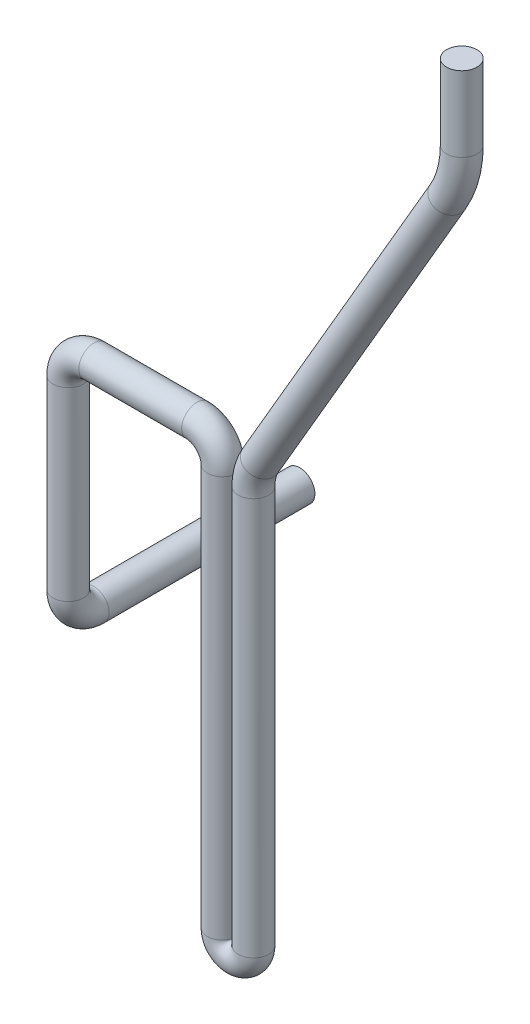
ISO-10303-21;
HEADER;
FILE_DESCRIPTION(('STEP AP214'),'2;1');
FILE_NAME('part.step','',(''),(''),'','','');
FILE_SCHEMA(('AUTOMOTIVE_DESIGN { 1 0 10303 214 1 1 1 1 }'));
ENDSEC;
DATA;
#1=APPLICATION_CONTEXT('core data for automotive mechanical design processes');
#2=APPLICATION_PROTOCOL_DEFINITION('international standard','automotive_design',2000,#1);
#3=PRODUCT_CONTEXT('',#1,'mechanical');
#4=PRODUCT('Part','Part','',(#3));
#5=PRODUCT_RELATED_PRODUCT_CATEGORY('part','',(#4));
#6=PRODUCT_DEFINITION_FORMATION('','',#4);
#7=PRODUCT_DEFINITION_CONTEXT('part definition',#1,'design');
#8=PRODUCT_DEFINITION('design','',#6,#7);
#9=PRODUCT_DEFINITION_SHAPE('','',#8);
#10=(LENGTH_UNIT() NAMED_UNIT(*) SI_UNIT(.MILLI.,.METRE.));
#11=(NAMED_UNIT(*) PLANE_ANGLE_UNIT() SI_UNIT($,.RADIAN.));
#12=(NAMED_UNIT(*) SI_UNIT($,.STERADIAN.) SOLID_ANGLE_UNIT());
#13=UNCERTAINTY_MEASURE_WITH_UNIT(LENGTH_MEASURE(1.E-05),#10,'distance_accuracy_value','');
#14=(GEOMETRIC_REPRESENTATION_CONTEXT(3) GLOBAL_UNCERTAINTY_ASSIGNED_CONTEXT((#13)) GLOBAL_UNIT_ASSIGNED_CONTEXT((#10,
#11,#12)) REPRESENTATION_CONTEXT('',''));
#15=CARTESIAN_POINT('',(0.,0.,0.));
#16=DIRECTION('',(0.,0.,1.));
#17=DIRECTION('',(1.,0.,0.));
#18=AXIS2_PLACEMENT_3D('',#15,#16,#17);
#19=CARTESIAN_POINT('',(11.25,7.5,0.));
#20=DIRECTION('',(0.,1.,0.));
#21=DIRECTION('',(0.,0.,1.));
#22=AXIS2_PLACEMENT_3D('',#19,#20,#21);
#23=CYLINDRICAL_SURFACE('',#22,0.295);
#24=CARTESIAN_POINT('',(11.25,7.5,0.));
#25=DIRECTION('',(0.,1.,0.));
#26=DIRECTION('',(1.,0.,0.));
#27=AXIS2_PLACEMENT_3D('',#24,#25,#26);
#28=CIRCLE('',#27,0.295);
#29=CARTESIAN_POINT('',(11.545,7.5,0.));
#30=VERTEX_POINT('',#29);
#31=EDGE_CURVE('E36',#30,#30,#28,.T.);
#32=ORIENTED_EDGE('',*,*,#31,.T.);
#33=EDGE_LOOP('',(#32));
#34=FACE_BOUND('',#33,.T.);
#35=CARTESIAN_POINT('',(11.25,8.96048512716335,0.));
#36=DIRECTION('',(0.,1.,0.));
#37=DIRECTION('',(1.,0.,0.));
#38=AXIS2_PLACEMENT_3D('',#35,#36,#37);
#39=CIRCLE('',#38,0.295);
#40=CARTESIAN_POINT('',(11.545,8.96048512716335,0.));
#41=VERTEX_POINT('',#40);
#42=EDGE_CURVE('E10',#41,#41,#39,.T.);
#43=ORIENTED_EDGE('',*,*,#42,.F.);
#44=EDGE_LOOP('',(#43));
#45=FACE_BOUND('',#44,.T.);
#46=ADVANCED_FACE('F30',(#34,#45),#23,.T.);
#47=CARTESIAN_POINT('',(9.25,7.5,0.));
#48=DIRECTION('',(0.,0.,1.));
#49=DIRECTION('',(1.,0.,0.));
#50=AXIS2_PLACEMENT_3D('',#47,#48,#49);
#51=TOROIDAL_SURFACE('',#50,2.,0.295);
#52=CARTESIAN_POINT('',(10.9786682614832,6.49416400852792,0.));
#53=DIRECTION('',(0.502917995736042,0.864334130741603,0.));
#54=DIRECTION('',(0.864334130741603,-0.502917995736042,0.));
#55=AXIS2_PLACEMENT_3D('',#52,#53,#54);
#56=CIRCLE('',#55,0.295);
#57=CARTESIAN_POINT('',(11.233646830052,6.34580319978579,0.));
#58=VERTEX_POINT('',#57);
#59=EDGE_CURVE('E40',#58,#58,#56,.T.);
#60=CARTESIAN_POINT('',(9.25,7.5,0.));
#61=DIRECTION('',(0.,0.,1.));
#62=DIRECTION('',(1.,0.,0.));
#63=AXIS2_PLACEMENT_3D('',#60,#61,#62);
#64=CIRCLE('',#63,2.295);
#65=EDGE_CURVE('',#58,#30,#64,.T.);
#66=ORIENTED_EDGE('',*,*,#59,.T.);
#67=ORIENTED_EDGE('',*,*,#31,.F.);
#68=ORIENTED_EDGE('',*,*,#65,.T.);
#69=ORIENTED_EDGE('',*,*,#65,.F.);
#70=EDGE_LOOP('',(#66,#68,#67,#69));
#71=FACE_BOUND('',#70,.T.);
#72=ADVANCED_FACE('F98',(#71),#51,.T.);
#73=CARTESIAN_POINT('',(7.3356658692584,0.233160559317716,0.));
#74=DIRECTION('',(0.502917995736039,0.864334130741605,0.));
#75=DIRECTION('',(-0.864334130741605,0.502917995736039,0.));
#76=AXIS2_PLACEMENT_3D('',#73,#74,#75);
#77=CYLINDRICAL_SURFACE('',#76,0.295);
#78=CARTESIAN_POINT('',(7.3356658692584,0.233160559317716,0.));
#79=DIRECTION('',(0.502917995736042,0.864334130741603,0.));
#80=DIRECTION('',(0.864334130741603,-0.502917995736042,0.));
#81=AXIS2_PLACEMENT_3D('',#78,#79,#80);
#82=CIRCLE('',#81,0.295);
#83=CARTESIAN_POINT('',(7.08068730068962,0.381521368059849,0.));
#84=VERTEX_POINT('',#83);
#85=EDGE_CURVE('E44',#84,#84,#82,.T.);
#86=ORIENTED_EDGE('',*,*,#85,.T.);
#87=EDGE_LOOP('',(#86));
#88=FACE_BOUND('',#87,.T.);
#89=ORIENTED_EDGE('',*,*,#59,.F.);
#90=EDGE_LOOP('',(#89));
#91=FACE_BOUND('',#90,.T.);
#92=ADVANCED_FACE('F102',(#88,#91),#77,.T.);
#93=CARTESIAN_POINT('',(8.2,-0.269757436418325,0.));
#94=DIRECTION('',(0.,0.,-1.));
#95=DIRECTION('',(-1.,0.,0.));
#96=AXIS2_PLACEMENT_3D('',#93,#94,#95);
#97=TOROIDAL_SURFACE('',#96,1.,0.295);
#98=CARTESIAN_POINT('',(7.2,-0.269757436418325,0.));
#99=DIRECTION('',(0.,1.,0.));
#100=DIRECTION('',(1.,0.,0.));
#101=AXIS2_PLACEMENT_3D('',#98,#99,#100);
#102=CIRCLE('',#101,0.295);
#103=CARTESIAN_POINT('',(6.905,-0.269757436418325,0.));
#104=VERTEX_POINT('',#103);
#105=EDGE_CURVE('E49',#104,#104,#102,.T.);
#106=CARTESIAN_POINT('',(8.2,-0.269757436418325,0.));
#107=DIRECTION('',(0.,0.,-1.));
#108=DIRECTION('',(-1.,0.,0.));
#109=AXIS2_PLACEMENT_3D('',#106,#107,#108);
#110=CIRCLE('',#109,1.295);
#111=EDGE_CURVE('',#104,#84,#110,.T.);
#112=ORIENTED_EDGE('',*,*,#105,.T.);
#113=ORIENTED_EDGE('',*,*,#85,.F.);
#114=ORIENTED_EDGE('',*,*,#111,.T.);
#115=ORIENTED_EDGE('',*,*,#111,.F.);
#116=EDGE_LOOP('',(#112,#114,#113,#115));
#117=FACE_BOUND('',#116,.T.);
#118=ADVANCED_FACE('F108',(#117),#97,.T.);
#119=CARTESIAN_POINT('',(7.2,-8.,0.));
#120=DIRECTION('',(0.,1.,0.));
#121=DIRECTION('',(0.,0.,1.));
#122=AXIS2_PLACEMENT_3D('',#119,#120,#121);
#123=CYLINDRICAL_SURFACE('',#122,0.295);
#124=CARTESIAN_POINT('',(7.2,-8.,0.));
#125=DIRECTION('',(0.,1.,0.));
#126=DIRECTION('',(1.,0.,0.));
#127=AXIS2_PLACEMENT_3D('',#124,#125,#126);
#128=CIRCLE('',#127,0.295);
#129=CARTESIAN_POINT('',(7.495,-8.,0.));
#130=VERTEX_POINT('',#129);
#131=EDGE_CURVE('E52',#130,#130,#128,.T.);
#132=ORIENTED_EDGE('',*,*,#131,.T.);
#133=EDGE_LOOP('',(#132));
#134=FACE_BOUND('',#133,.T.);
#135=ORIENTED_EDGE('',*,*,#105,.F.);
#136=EDGE_LOOP('',(#135));
#137=FACE_BOUND('',#136,.T.);
#138=ADVANCED_FACE('F115',(#134,#137),#123,.T.);
#139=CARTESIAN_POINT('',(6.9,-8.,0.));
#140=DIRECTION('',(0.,0.,1.));
#141=DIRECTION('',(1.,0.,0.));
#142=AXIS2_PLACEMENT_3D('',#139,#140,#141);
#143=TOROIDAL_SURFACE('',#142,0.3,0.295);
#144=CARTESIAN_POINT('',(6.6,-8.,0.));
#145=DIRECTION('',(0.,-1.,0.));
#146=DIRECTION('',(-1.,0.,0.));
#147=AXIS2_PLACEMENT_3D('',#144,#145,#146);
#148=CIRCLE('',#147,0.295);
#149=CARTESIAN_POINT('',(6.305,-8.,0.));
#150=VERTEX_POINT('',#149);
#151=EDGE_CURVE('E55',#150,#150,#148,.T.);
#152=CARTESIAN_POINT('',(6.9,-8.,0.));
#153=DIRECTION('',(0.,0.,1.));
#154=DIRECTION('',(1.,0.,0.));
#155=AXIS2_PLACEMENT_3D('',#152,#153,#154);
#156=CIRCLE('',#155,0.595);
#157=EDGE_CURVE('',#150,#130,#156,.T.);
#158=ORIENTED_EDGE('',*,*,#151,.T.);
#159=ORIENTED_EDGE('',*,*,#131,.F.);
#160=ORIENTED_EDGE('',*,*,#157,.T.);
#161=ORIENTED_EDGE('',*,*,#157,.F.);
#162=EDGE_LOOP('',(#158,#160,#159,#161));
#163=FACE_BOUND('',#162,.T.);
#164=ADVANCED_FACE('F119',(#163),#143,.T.);
#165=CARTESIAN_POINT('',(6.6,-0.200000000000001,0.));
#166=DIRECTION('',(0.,-1.,0.));
#167=DIRECTION('',(0.,0.,-1.));
#168=AXIS2_PLACEMENT_3D('',#165,#166,#167);
#169=CYLINDRICAL_SURFACE('',#168,0.295);
#170=CARTESIAN_POINT('',(6.6,-0.200000000000001,0.));
#171=DIRECTION('',(0.,-1.,0.));
#172=DIRECTION('',(-1.,0.,0.));
#173=AXIS2_PLACEMENT_3D('',#170,#171,#172);
#174=CIRCLE('',#173,0.295);
#175=CARTESIAN_POINT('',(6.895,-0.200000000000001,0.));
#176=VERTEX_POINT('',#175);
#177=EDGE_CURVE('E58',#176,#176,#174,.T.);
#178=ORIENTED_EDGE('',*,*,#177,.T.);
#179=EDGE_LOOP('',(#178));
#180=FACE_BOUND('',#179,.T.);
#181=ORIENTED_EDGE('',*,*,#151,.F.);
#182=EDGE_LOOP('',(#181));
#183=FACE_BOUND('',#182,.T.);
#184=ADVANCED_FACE('F123',(#180,#183),#169,.T.);
#185=CARTESIAN_POINT('',(6.1,-0.2,0.));
#186=DIRECTION('',(0.,0.,-1.));
#187=DIRECTION('',(-1.,0.,0.));
#188=AXIS2_PLACEMENT_3D('',#185,#186,#187);
#189=TOROIDAL_SURFACE('',#188,0.5,0.295);
#190=CARTESIAN_POINT('',(6.1,0.3,0.));
#191=DIRECTION('',(1.,0.,0.));
#192=DIRECTION('',(0.,-1.,0.));
#193=AXIS2_PLACEMENT_3D('',#190,#191,#192);
#194=CIRCLE('',#193,0.295);
#195=CARTESIAN_POINT('',(6.1,0.595,0.));
#196=VERTEX_POINT('',#195);
#197=EDGE_CURVE('E61',#196,#196,#194,.T.);
#198=CARTESIAN_POINT('',(6.1,-0.2,0.));
#199=DIRECTION('',(0.,0.,-1.));
#200=DIRECTION('',(-1.,0.,0.));
#201=AXIS2_PLACEMENT_3D('',#198,#199,#200);
#202=CIRCLE('',#201,0.795);
#203=EDGE_CURVE('',#196,#176,#202,.T.);
#204=ORIENTED_EDGE('',*,*,#197,.T.);
#205=ORIENTED_EDGE('',*,*,#177,.F.);
#206=ORIENTED_EDGE('',*,*,#203,.T.);
#207=ORIENTED_EDGE('',*,*,#203,.F.);
#208=EDGE_LOOP('',(#204,#206,#205,#207));
#209=FACE_BOUND('',#208,.T.);
#210=ADVANCED_FACE('F127',(#209),#189,.T.);
#211=CARTESIAN_POINT('',(4.1,0.299999999999999,0.));
#212=DIRECTION('',(1.,0.,0.));
#213=DIRECTION('',(0.,1.,0.));
#214=AXIS2_PLACEMENT_3D('',#211,#212,#213);
#215=CYLINDRICAL_SURFACE('',#214,0.295);
#216=CARTESIAN_POINT('',(4.1,0.299999999999999,0.));
#217=DIRECTION('',(1.,0.,0.));
#218=DIRECTION('',(0.,-1.,0.));
#219=AXIS2_PLACEMENT_3D('',#216,#217,#218);
#220=CIRCLE('',#219,0.295);
#221=CARTESIAN_POINT('',(4.1,0.595,0.));
#222=VERTEX_POINT('',#221);
#223=EDGE_CURVE('E64',#222,#222,#220,.T.);
#224=ORIENTED_EDGE('',*,*,#223,.T.);
#225=EDGE_LOOP('',(#224));
#226=FACE_BOUND('',#225,.T.);
#227=ORIENTED_EDGE('',*,*,#197,.F.);
#228=EDGE_LOOP('',(#227));
#229=FACE_BOUND('',#228,.T.);
#230=ADVANCED_FACE('F131',(#226,#229),#215,.T.);
#231=CARTESIAN_POINT('',(4.1,-0.2,0.));
#232=DIRECTION('',(0.,0.,-1.));
#233=DIRECTION('',(-1.,0.,0.));
#234=AXIS2_PLACEMENT_3D('',#231,#232,#233);
#235=TOROIDAL_SURFACE('',#234,0.5,0.295);
#236=CARTESIAN_POINT('',(3.6,-0.199999999999999,0.));
#237=DIRECTION('',(0.,1.,0.));
#238=DIRECTION('',(1.,0.,0.));
#239=AXIS2_PLACEMENT_3D('',#236,#237,#238);
#240=CIRCLE('',#239,0.295);
#241=CARTESIAN_POINT('',(3.305,-0.199999999999999,0.));
#242=VERTEX_POINT('',#241);
#243=EDGE_CURVE('E67',#242,#242,#240,.T.);
#244=CARTESIAN_POINT('',(4.1,-0.2,0.));
#245=DIRECTION('',(0.,0.,-1.));
#246=DIRECTION('',(-1.,0.,0.));
#247=AXIS2_PLACEMENT_3D('',#244,#245,#246);
#248=CIRCLE('',#247,0.795);
#249=EDGE_CURVE('',#242,#222,#248,.T.);
#250=ORIENTED_EDGE('',*,*,#243,.T.);
#251=ORIENTED_EDGE('',*,*,#223,.F.);
#252=ORIENTED_EDGE('',*,*,#249,.T.);
#253=ORIENTED_EDGE('',*,*,#249,.F.);
#254=EDGE_LOOP('',(#250,#252,#251,#253));
#255=FACE_BOUND('',#254,.T.);
#256=ADVANCED_FACE('F135',(#255),#235,.T.);
#257=CARTESIAN_POINT('',(3.6,-3.8,0.));
#258=DIRECTION('',(0.,1.,0.));
#259=DIRECTION('',(0.,0.,1.));
#260=AXIS2_PLACEMENT_3D('',#257,#258,#259);
#261=CYLINDRICAL_SURFACE('',#260,0.295);
#262=CARTESIAN_POINT('',(3.6,-3.8,0.));
#263=DIRECTION('',(0.,1.,0.));
#264=DIRECTION('',(1.,0.,0.));
#265=AXIS2_PLACEMENT_3D('',#262,#263,#264);
#266=CIRCLE('',#265,0.295);
#267=CARTESIAN_POINT('',(3.6,-3.8,0.295000000000001));
#268=VERTEX_POINT('',#267);
#269=EDGE_CURVE('E70',#268,#268,#266,.T.);
#270=ORIENTED_EDGE('',*,*,#269,.T.);
#271=EDGE_LOOP('',(#270));
#272=FACE_BOUND('',#271,.T.);
#273=ORIENTED_EDGE('',*,*,#243,.F.);
#274=EDGE_LOOP('',(#273));
#275=FACE_BOUND('',#274,.T.);
#276=ADVANCED_FACE('F139',(#272,#275),#261,.T.);
#277=CARTESIAN_POINT('',(3.6,-3.8,-0.499999999999999));
#278=DIRECTION('',(-1.,0.,0.));
#279=DIRECTION('',(0.,0.,1.));
#280=AXIS2_PLACEMENT_3D('',#277,#278,#279);
#281=TOROIDAL_SURFACE('',#280,0.5,0.295);
#282=CARTESIAN_POINT('',(3.6,-4.3,-0.500000000000002));
#283=DIRECTION('',(0.,0.,1.));
#284=DIRECTION('',(1.,0.,0.));
#285=AXIS2_PLACEMENT_3D('',#282,#283,#284);
#286=CIRCLE('',#285,0.295);
#287=CARTESIAN_POINT('',(3.6,-4.595,-0.500000000000004));
#288=VERTEX_POINT('',#287);
#289=EDGE_CURVE('E73',#288,#288,#286,.T.);
#290=CARTESIAN_POINT('',(3.6,-3.8,-0.499999999999999));
#291=DIRECTION('',(-1.,0.,0.));
#292=DIRECTION('',(0.,0.,1.));
#293=AXIS2_PLACEMENT_3D('',#290,#291,#292);
#294=CIRCLE('',#293,0.795);
#295=EDGE_CURVE('',#288,#268,#294,.T.);
#296=ORIENTED_EDGE('',*,*,#289,.T.);
#297=ORIENTED_EDGE('',*,*,#269,.F.);
#298=ORIENTED_EDGE('',*,*,#295,.T.);
#299=ORIENTED_EDGE('',*,*,#295,.F.);
#300=EDGE_LOOP('',(#296,#298,#297,#299));
#301=FACE_BOUND('',#300,.T.);
#302=ADVANCED_FACE('F80',(#301),#281,.T.);
#303=CARTESIAN_POINT('',(3.6,-4.3,-0.500000000000002));
#304=DIRECTION('',(0.,0.,-1.));
#305=DIRECTION('',(-1.,0.,0.));
#306=AXIS2_PLACEMENT_3D('',#303,#304,#305);
#307=CYLINDRICAL_SURFACE('',#306,0.295);
#308=ORIENTED_EDGE('',*,*,#289,.F.);
#309=EDGE_LOOP('',(#308));
#310=FACE_BOUND('',#309,.T.);
#311=CARTESIAN_POINT('',(3.6,-4.3,-4.5));
#312=DIRECTION('',(0.,0.,1.));
#313=DIRECTION('',(1.,0.,0.));
#314=AXIS2_PLACEMENT_3D('',#311,#312,#313);
#315=CIRCLE('',#314,0.295);
#316=CARTESIAN_POINT('',(3.895,-4.3,-4.5));
#317=VERTEX_POINT('',#316);
#318=EDGE_CURVE('E74',#317,#317,#315,.T.);
#319=ORIENTED_EDGE('',*,*,#318,.T.);
#320=EDGE_LOOP('',(#319));
#321=FACE_BOUND('',#320,.T.);
#322=ADVANCED_FACE('F83',(#310,#321),#307,.T.);
#323=CARTESIAN_POINT('',(11.25,8.96048512716335,0.));
#324=DIRECTION('',(0.,1.,0.));
#325=DIRECTION('',(1.,0.,0.));
#326=AXIS2_PLACEMENT_3D('',#323,#324,#325);
#327=PLANE('',#326);
#328=ORIENTED_EDGE('',*,*,#42,.T.);
#329=EDGE_LOOP('',(#328));
#330=FACE_BOUND('',#329,.T.);
#331=ADVANCED_FACE('F86',(#330),#327,.T.);
#332=CARTESIAN_POINT('',(3.6,-4.3,-4.5));
#333=DIRECTION('',(0.,0.,1.));
#334=DIRECTION('',(1.,0.,0.));
#335=AXIS2_PLACEMENT_3D('',#332,#333,#334);
#336=PLANE('',#335);
#337=ORIENTED_EDGE('',*,*,#318,.F.);
#338=EDGE_LOOP('',(#337));
#339=FACE_BOUND('',#338,.T.);
#340=ADVANCED_FACE('F90',(#339),#336,.F.);
#341=CLOSED_SHELL('',(#46,#72,#92,#118,#138,#164,#184,#210,#230,#256,#276,#302,#322,#331,#340));
#342=MANIFOLD_SOLID_BREP('B2',#341);
#343=ADVANCED_BREP_SHAPE_REPRESENTATION('',(#18,#342),#14);
#344=SHAPE_DEFINITION_REPRESENTATION(#9,#343);
ENDSEC;
END-ISO-10303-21;
